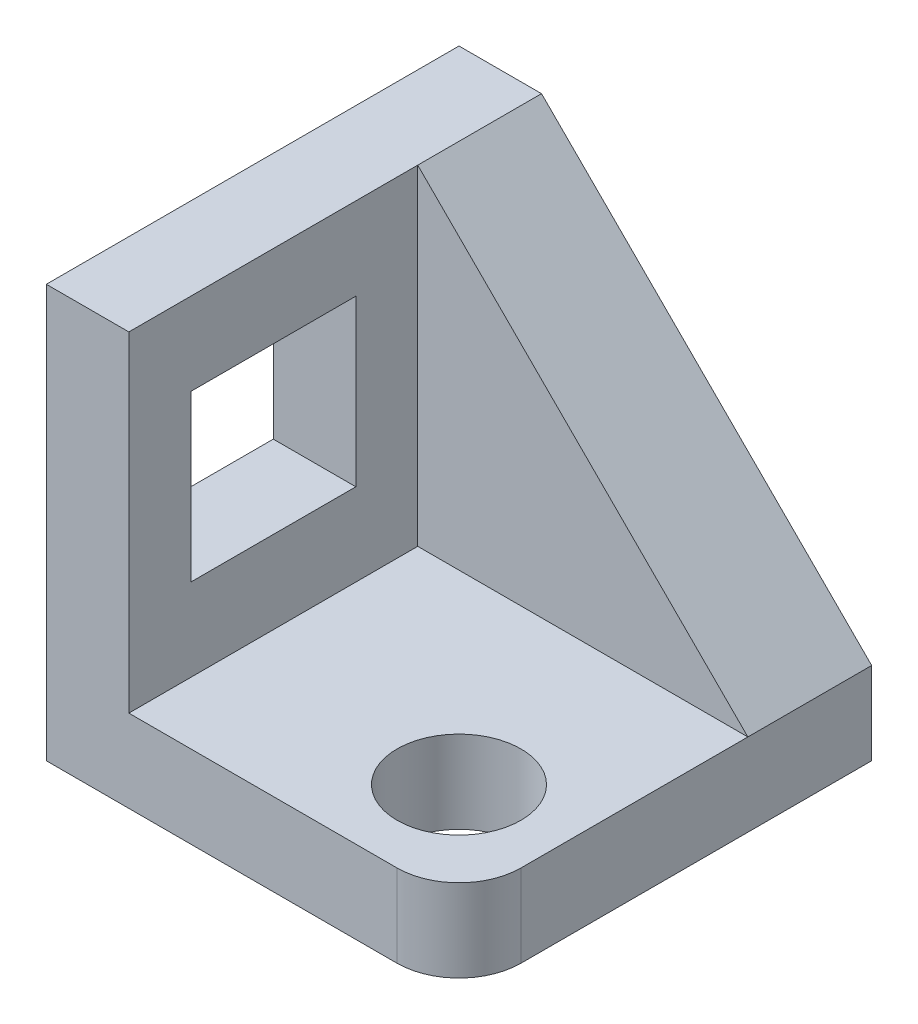
ISO-10303-21;
HEADER;
FILE_DESCRIPTION(('STEP AP214'),'2;1');
FILE_NAME('part.step','',(''),(''),'','','');
FILE_SCHEMA(('AUTOMOTIVE_DESIGN { 1 0 10303 214 1 1 1 1 }'));
ENDSEC;
DATA;
#1=APPLICATION_CONTEXT('core data for automotive mechanical design processes');
#2=APPLICATION_PROTOCOL_DEFINITION('international standard','automotive_design',2000,#1);
#3=PRODUCT_CONTEXT('',#1,'mechanical');
#4=PRODUCT('Part','Part','',(#3));
#5=PRODUCT_RELATED_PRODUCT_CATEGORY('part','',(#4));
#6=PRODUCT_DEFINITION_FORMATION('','',#4);
#7=PRODUCT_DEFINITION_CONTEXT('part definition',#1,'design');
#8=PRODUCT_DEFINITION('design','',#6,#7);
#9=PRODUCT_DEFINITION_SHAPE('','',#8);
#10=(LENGTH_UNIT() NAMED_UNIT(*) SI_UNIT(.MILLI.,.METRE.));
#11=(NAMED_UNIT(*) PLANE_ANGLE_UNIT() SI_UNIT($,.RADIAN.));
#12=(NAMED_UNIT(*) SI_UNIT($,.STERADIAN.) SOLID_ANGLE_UNIT());
#13=UNCERTAINTY_MEASURE_WITH_UNIT(LENGTH_MEASURE(1.E-05),#10,'distance_accuracy_value','');
#14=(GEOMETRIC_REPRESENTATION_CONTEXT(3) GLOBAL_UNCERTAINTY_ASSIGNED_CONTEXT((#13)) GLOBAL_UNIT_ASSIGNED_CONTEXT((#10,
#11,#12)) REPRESENTATION_CONTEXT('',''));
#15=CARTESIAN_POINT('',(0.,0.,0.));
#16=DIRECTION('',(0.,0.,1.));
#17=DIRECTION('',(1.,0.,0.));
#18=AXIS2_PLACEMENT_3D('',#15,#16,#17);
#19=CARTESIAN_POINT('',(0.,20.,0.));
#20=DIRECTION('',(0.,1.,0.));
#21=DIRECTION('',(0.,0.,1.));
#22=AXIS2_PLACEMENT_3D('',#19,#20,#21);
#23=PLANE('',#22);
#24=CARTESIAN_POINT('',(25.,20.,25.));
#25=DIRECTION('',(0.,1.,0.));
#26=DIRECTION('',(0.,0.,1.));
#27=AXIS2_PLACEMENT_3D('',#24,#25,#26);
#28=CIRCLE('',#27,15.);
#29=CARTESIAN_POINT('',(25.,20.,40.));
#30=VERTEX_POINT('',#29);
#31=EDGE_CURVE('E160',#30,#30,#28,.T.);
#32=ORIENTED_EDGE('',*,*,#31,.F.);
#33=EDGE_LOOP('',(#32));
#34=FACE_BOUND('',#33,.T.);
#35=DIRECTION('',(1.,0.,0.));
#36=VECTOR('',#35,1.);
#37=CARTESIAN_POINT('',(-50.,20.,50.));
#38=LINE('',#37,#36);
#39=CARTESIAN_POINT('',(-30.,20.,50.));
#40=VERTEX_POINT('',#39);
#41=CARTESIAN_POINT('',(35.,20.,50.));
#42=VERTEX_POINT('',#41);
#43=EDGE_CURVE('E217',#40,#42,#38,.T.);
#44=ORIENTED_EDGE('',*,*,#43,.T.);
#45=CARTESIAN_POINT('',(35.,20.,35.));
#46=DIRECTION('',(0.,1.,0.));
#47=DIRECTION('',(0.,0.,1.));
#48=AXIS2_PLACEMENT_3D('',#45,#46,#47);
#49=CIRCLE('',#48,15.);
#50=CARTESIAN_POINT('',(50.,20.,35.));
#51=VERTEX_POINT('',#50);
#52=EDGE_CURVE('E258',#42,#51,#49,.T.);
#53=ORIENTED_EDGE('',*,*,#52,.T.);
#54=DIRECTION('',(0.,0.,-1.));
#55=VECTOR('',#54,1.);
#56=CARTESIAN_POINT('',(50.,20.,-50.));
#57=LINE('',#56,#55);
#58=CARTESIAN_POINT('',(50.,20.,-20.));
#59=VERTEX_POINT('',#58);
#60=EDGE_CURVE('E214',#51,#59,#57,.T.);
#61=ORIENTED_EDGE('',*,*,#60,.T.);
#62=DIRECTION('',(1.,0.,0.));
#63=VECTOR('',#62,1.);
#64=CARTESIAN_POINT('',(-30.,20.,-20.));
#65=LINE('',#64,#63);
#66=CARTESIAN_POINT('',(-30.,20.,-20.));
#67=VERTEX_POINT('',#66);
#68=EDGE_CURVE('E184',#67,#59,#65,.T.);
#69=ORIENTED_EDGE('',*,*,#68,.F.);
#70=DIRECTION('',(0.,0.,-1.));
#71=VECTOR('',#70,1.);
#72=CARTESIAN_POINT('',(-30.,20.,-50.));
#73=LINE('',#72,#71);
#74=EDGE_CURVE('E191',#40,#67,#73,.T.);
#75=ORIENTED_EDGE('',*,*,#74,.F.);
#76=EDGE_LOOP('',(#44,#53,#61,#69,#75));
#77=FACE_BOUND('',#76,.T.);
#78=ADVANCED_FACE('F39',(#34,#77),#23,.T.);
#79=CARTESIAN_POINT('',(-30.,100.,-50.));
#80=DIRECTION('',(-1.,0.,0.));
#81=DIRECTION('',(0.,0.,1.));
#82=AXIS2_PLACEMENT_3D('',#79,#80,#81);
#83=PLANE('',#82);
#84=DIRECTION('',(0.,0.,1.));
#85=VECTOR('',#84,1.);
#86=CARTESIAN_POINT('',(-30.,80.,-5.00000000000002));
#87=LINE('',#86,#85);
#88=CARTESIAN_POINT('',(-30.,80.,-5.00000000000002));
#89=VERTEX_POINT('',#88);
#90=CARTESIAN_POINT('',(-30.,80.,35.));
#91=VERTEX_POINT('',#90);
#92=EDGE_CURVE('E142',#89,#91,#87,.T.);
#93=ORIENTED_EDGE('',*,*,#92,.F.);
#94=DIRECTION('',(0.,1.,0.));
#95=VECTOR('',#94,1.);
#96=CARTESIAN_POINT('',(-30.,80.,-5.00000000000002));
#97=LINE('',#96,#95);
#98=CARTESIAN_POINT('',(-30.,40.,-5.00000000000004));
#99=VERTEX_POINT('',#98);
#100=EDGE_CURVE('E55',#99,#89,#97,.T.);
#101=ORIENTED_EDGE('',*,*,#100,.F.);
#102=DIRECTION('',(0.,0.,-1.));
#103=VECTOR('',#102,1.);
#104=CARTESIAN_POINT('',(-30.,40.,-5.00000000000004));
#105=LINE('',#104,#103);
#106=CARTESIAN_POINT('',(-30.,40.,35.));
#107=VERTEX_POINT('',#106);
#108=EDGE_CURVE('E150',#107,#99,#105,.T.);
#109=ORIENTED_EDGE('',*,*,#108,.F.);
#110=DIRECTION('',(0.,-1.,0.));
#111=VECTOR('',#110,1.);
#112=CARTESIAN_POINT('',(-30.,80.,35.));
#113=LINE('',#112,#111);
#114=EDGE_CURVE('E132',#91,#107,#113,.T.);
#115=ORIENTED_EDGE('',*,*,#114,.F.);
#116=EDGE_LOOP('',(#93,#101,#109,#115));
#117=FACE_BOUND('',#116,.T.);
#118=DIRECTION('',(0.,-1.,0.));
#119=VECTOR('',#118,1.);
#120=CARTESIAN_POINT('',(-30.,100.,-20.));
#121=LINE('',#120,#119);
#122=CARTESIAN_POINT('',(-30.,100.,-20.));
#123=VERTEX_POINT('',#122);
#124=EDGE_CURVE('E188',#123,#67,#121,.T.);
#125=ORIENTED_EDGE('',*,*,#124,.F.);
#126=DIRECTION('',(0.,0.,-1.));
#127=VECTOR('',#126,1.);
#128=CARTESIAN_POINT('',(-30.,100.,-50.));
#129=LINE('',#128,#127);
#130=CARTESIAN_POINT('',(-30.,100.,50.));
#131=VERTEX_POINT('',#130);
#132=EDGE_CURVE('E199',#131,#123,#129,.T.);
#133=ORIENTED_EDGE('',*,*,#132,.F.);
#134=DIRECTION('',(0.,-1.,0.));
#135=VECTOR('',#134,1.);
#136=CARTESIAN_POINT('',(-30.,100.,50.));
#137=LINE('',#136,#135);
#138=EDGE_CURVE('E206',#131,#40,#137,.T.);
#139=ORIENTED_EDGE('',*,*,#138,.T.);
#140=ORIENTED_EDGE('',*,*,#74,.T.);
#141=EDGE_LOOP('',(#125,#133,#139,#140));
#142=FACE_BOUND('',#141,.T.);
#143=ADVANCED_FACE('F147',(#117,#142),#83,.F.);
#144=CARTESIAN_POINT('',(50.,20.,-50.));
#145=DIRECTION('',(-1.,0.,0.));
#146=DIRECTION('',(0.,0.,1.));
#147=AXIS2_PLACEMENT_3D('',#144,#145,#146);
#148=PLANE('',#147);
#149=ORIENTED_EDGE('',*,*,#60,.F.);
#150=DIRECTION('',(0.,-1.,0.));
#151=VECTOR('',#150,1.);
#152=CARTESIAN_POINT('',(50.,20.,35.));
#153=LINE('',#152,#151);
#154=CARTESIAN_POINT('',(50.,0.,35.));
#155=VERTEX_POINT('',#154);
#156=EDGE_CURVE('E245',#51,#155,#153,.T.);
#157=ORIENTED_EDGE('',*,*,#156,.T.);
#158=DIRECTION('',(0.,0.,-1.));
#159=VECTOR('',#158,1.);
#160=CARTESIAN_POINT('',(50.,0.,-50.));
#161=LINE('',#160,#159);
#162=CARTESIAN_POINT('',(50.,0.,-50.));
#163=VERTEX_POINT('',#162);
#164=EDGE_CURVE('E213',#155,#163,#161,.T.);
#165=ORIENTED_EDGE('',*,*,#164,.T.);
#166=DIRECTION('',(0.,-1.,0.));
#167=VECTOR('',#166,1.);
#168=CARTESIAN_POINT('',(50.,20.,-50.));
#169=LINE('',#168,#167);
#170=CARTESIAN_POINT('',(50.,20.,-50.));
#171=VERTEX_POINT('',#170);
#172=EDGE_CURVE('E241',#171,#163,#169,.T.);
#173=ORIENTED_EDGE('',*,*,#172,.F.);
#174=DIRECTION('',(0.,0.,1.));
#175=VECTOR('',#174,1.);
#176=CARTESIAN_POINT('',(50.,20.,-100.));
#177=LINE('',#176,#175);
#178=EDGE_CURVE('E174',#171,#59,#177,.T.);
#179=ORIENTED_EDGE('',*,*,#178,.T.);
#180=EDGE_LOOP('',(#149,#157,#165,#173,#179));
#181=FACE_BOUND('',#180,.T.);
#182=ADVANCED_FACE('F291',(#181),#148,.F.);
#183=CARTESIAN_POINT('',(-50.,20.,-50.));
#184=DIRECTION('',(0.,0.,1.));
#185=DIRECTION('',(1.,0.,0.));
#186=AXIS2_PLACEMENT_3D('',#183,#184,#185);
#187=PLANE('',#186);
#188=DIRECTION('',(-1.,0.,0.));
#189=VECTOR('',#188,1.);
#190=CARTESIAN_POINT('',(-50.,100.,-50.));
#191=LINE('',#190,#189);
#192=CARTESIAN_POINT('',(-30.,100.,-50.));
#193=VERTEX_POINT('',#192);
#194=CARTESIAN_POINT('',(-50.,100.,-50.));
#195=VERTEX_POINT('',#194);
#196=EDGE_CURVE('E203',#193,#195,#191,.T.);
#197=ORIENTED_EDGE('',*,*,#196,.F.);
#198=DIRECTION('',(0.707106781186548,-0.707106781186547,0.));
#199=VECTOR('',#198,1.);
#200=CARTESIAN_POINT('',(0.,70.,-50.));
#201=LINE('',#200,#199);
#202=EDGE_CURVE('E178',#193,#171,#201,.T.);
#203=ORIENTED_EDGE('',*,*,#202,.T.);
#204=ORIENTED_EDGE('',*,*,#172,.T.);
#205=DIRECTION('',(-1.,0.,0.));
#206=VECTOR('',#205,1.);
#207=CARTESIAN_POINT('',(-50.,0.,-50.));
#208=LINE('',#207,#206);
#209=CARTESIAN_POINT('',(-50.,0.,-50.));
#210=VERTEX_POINT('',#209);
#211=EDGE_CURVE('E225',#163,#210,#208,.T.);
#212=ORIENTED_EDGE('',*,*,#211,.T.);
#213=DIRECTION('',(0.,-1.,0.));
#214=VECTOR('',#213,1.);
#215=CARTESIAN_POINT('',(-50.,20.,-50.));
#216=LINE('',#215,#214);
#217=EDGE_CURVE('E237',#195,#210,#216,.T.);
#218=ORIENTED_EDGE('',*,*,#217,.F.);
#219=EDGE_LOOP('',(#197,#203,#204,#212,#218));
#220=FACE_BOUND('',#219,.T.);
#221=ADVANCED_FACE('F308',(#220),#187,.F.);
#222=CARTESIAN_POINT('',(-50.,20.,-50.));
#223=DIRECTION('',(1.,0.,0.));
#224=DIRECTION('',(0.,0.,-1.));
#225=AXIS2_PLACEMENT_3D('',#222,#223,#224);
#226=PLANE('',#225);
#227=DIRECTION('',(0.,0.,-1.));
#228=VECTOR('',#227,1.);
#229=CARTESIAN_POINT('',(-50.,40.,-50.));
#230=LINE('',#229,#228);
#231=CARTESIAN_POINT('',(-50.,40.,35.));
#232=VERTEX_POINT('',#231);
#233=CARTESIAN_POINT('',(-50.,40.,-5.00000000000003));
#234=VERTEX_POINT('',#233);
#235=EDGE_CURVE('E48',#232,#234,#230,.T.);
#236=ORIENTED_EDGE('',*,*,#235,.T.);
#237=DIRECTION('',(0.,1.,0.));
#238=VECTOR('',#237,1.);
#239=CARTESIAN_POINT('',(-50.,20.,-5.00000000000004));
#240=LINE('',#239,#238);
#241=CARTESIAN_POINT('',(-50.,80.,-5.00000000000002));
#242=VERTEX_POINT('',#241);
#243=EDGE_CURVE('E11',#234,#242,#240,.T.);
#244=ORIENTED_EDGE('',*,*,#243,.T.);
#245=DIRECTION('',(0.,0.,1.));
#246=VECTOR('',#245,1.);
#247=CARTESIAN_POINT('',(-50.,80.,-50.));
#248=LINE('',#247,#246);
#249=CARTESIAN_POINT('',(-50.,80.,35.));
#250=VERTEX_POINT('',#249);
#251=EDGE_CURVE('E261',#242,#250,#248,.T.);
#252=ORIENTED_EDGE('',*,*,#251,.T.);
#253=DIRECTION('',(0.,-1.,0.));
#254=VECTOR('',#253,1.);
#255=CARTESIAN_POINT('',(-50.,20.,35.));
#256=LINE('',#255,#254);
#257=EDGE_CURVE('E135',#250,#232,#256,.T.);
#258=ORIENTED_EDGE('',*,*,#257,.T.);
#259=EDGE_LOOP('',(#236,#244,#252,#258));
#260=FACE_BOUND('',#259,.T.);
#261=DIRECTION('',(0.,0.,1.));
#262=VECTOR('',#261,1.);
#263=CARTESIAN_POINT('',(-50.,0.,-50.));
#264=LINE('',#263,#262);
#265=CARTESIAN_POINT('',(-50.,0.,50.));
#266=VERTEX_POINT('',#265);
#267=EDGE_CURVE('E228',#210,#266,#264,.T.);
#268=ORIENTED_EDGE('',*,*,#267,.T.);
#269=DIRECTION('',(0.,-1.,0.));
#270=VECTOR('',#269,1.);
#271=CARTESIAN_POINT('',(-50.,20.,50.));
#272=LINE('',#271,#270);
#273=CARTESIAN_POINT('',(-50.,100.,50.));
#274=VERTEX_POINT('',#273);
#275=EDGE_CURVE('E222',#274,#266,#272,.T.);
#276=ORIENTED_EDGE('',*,*,#275,.F.);
#277=DIRECTION('',(0.,0.,1.));
#278=VECTOR('',#277,1.);
#279=CARTESIAN_POINT('',(-50.,100.,-50.));
#280=LINE('',#279,#278);
#281=EDGE_CURVE('E192',#195,#274,#280,.T.);
#282=ORIENTED_EDGE('',*,*,#281,.F.);
#283=ORIENTED_EDGE('',*,*,#217,.T.);
#284=EDGE_LOOP('',(#268,#276,#282,#283));
#285=FACE_BOUND('',#284,.T.);
#286=ADVANCED_FACE('F268',(#260,#285),#226,.F.);
#287=CARTESIAN_POINT('',(-50.,20.,50.));
#288=DIRECTION('',(0.,0.,-1.));
#289=DIRECTION('',(-1.,0.,0.));
#290=AXIS2_PLACEMENT_3D('',#287,#288,#289);
#291=PLANE('',#290);
#292=DIRECTION('',(1.,0.,0.));
#293=VECTOR('',#292,1.);
#294=CARTESIAN_POINT('',(-50.,0.,50.));
#295=LINE('',#294,#293);
#296=CARTESIAN_POINT('',(35.,0.,50.));
#297=VERTEX_POINT('',#296);
#298=EDGE_CURVE('E218',#266,#297,#295,.T.);
#299=ORIENTED_EDGE('',*,*,#298,.T.);
#300=DIRECTION('',(0.,-1.,0.));
#301=VECTOR('',#300,1.);
#302=CARTESIAN_POINT('',(35.,20.,50.));
#303=LINE('',#302,#301);
#304=EDGE_CURVE('E255',#297,#42,#303,.F.);
#305=ORIENTED_EDGE('',*,*,#304,.T.);
#306=ORIENTED_EDGE('',*,*,#43,.F.);
#307=ORIENTED_EDGE('',*,*,#138,.F.);
#308=DIRECTION('',(1.,0.,0.));
#309=VECTOR('',#308,1.);
#310=CARTESIAN_POINT('',(-50.,100.,50.));
#311=LINE('',#310,#309);
#312=EDGE_CURVE('E196',#274,#131,#311,.T.);
#313=ORIENTED_EDGE('',*,*,#312,.F.);
#314=ORIENTED_EDGE('',*,*,#275,.T.);
#315=EDGE_LOOP('',(#299,#305,#306,#307,#313,#314));
#316=FACE_BOUND('',#315,.T.);
#317=ADVANCED_FACE('F301',(#316),#291,.F.);
#318=CARTESIAN_POINT('',(0.,0.,0.));
#319=DIRECTION('',(0.,1.,0.));
#320=DIRECTION('',(0.,0.,1.));
#321=AXIS2_PLACEMENT_3D('',#318,#319,#320);
#322=PLANE('',#321);
#323=CARTESIAN_POINT('',(25.,0.,25.));
#324=DIRECTION('',(0.,1.,0.));
#325=DIRECTION('',(0.,0.,1.));
#326=AXIS2_PLACEMENT_3D('',#323,#324,#325);
#327=CIRCLE('',#326,15.);
#328=CARTESIAN_POINT('',(25.,0.,40.));
#329=VERTEX_POINT('',#328);
#330=EDGE_CURVE('E168',#329,#329,#327,.T.);
#331=ORIENTED_EDGE('',*,*,#330,.T.);
#332=EDGE_LOOP('',(#331));
#333=FACE_BOUND('',#332,.T.);
#334=ORIENTED_EDGE('',*,*,#164,.F.);
#335=CARTESIAN_POINT('',(35.,0.,35.));
#336=DIRECTION('',(0.,1.,0.));
#337=DIRECTION('',(0.,0.,1.));
#338=AXIS2_PLACEMENT_3D('',#335,#336,#337);
#339=CIRCLE('',#338,15.);
#340=EDGE_CURVE('E252',#155,#297,#339,.F.);
#341=ORIENTED_EDGE('',*,*,#340,.T.);
#342=ORIENTED_EDGE('',*,*,#298,.F.);
#343=ORIENTED_EDGE('',*,*,#267,.F.);
#344=ORIENTED_EDGE('',*,*,#211,.F.);
#345=EDGE_LOOP('',(#334,#341,#342,#343,#344));
#346=FACE_BOUND('',#345,.T.);
#347=ADVANCED_FACE('F297',(#333,#346),#322,.F.);
#348=CARTESIAN_POINT('',(0.,100.,0.));
#349=DIRECTION('',(0.,1.,0.));
#350=DIRECTION('',(0.,0.,1.));
#351=AXIS2_PLACEMENT_3D('',#348,#349,#350);
#352=PLANE('',#351);
#353=DIRECTION('',(0.,0.,1.));
#354=VECTOR('',#353,1.);
#355=CARTESIAN_POINT('',(-30.,100.,-100.));
#356=LINE('',#355,#354);
#357=EDGE_CURVE('E173',#193,#123,#356,.T.);
#358=ORIENTED_EDGE('',*,*,#357,.F.);
#359=ORIENTED_EDGE('',*,*,#196,.T.);
#360=ORIENTED_EDGE('',*,*,#281,.T.);
#361=ORIENTED_EDGE('',*,*,#312,.T.);
#362=ORIENTED_EDGE('',*,*,#132,.T.);
#363=EDGE_LOOP('',(#358,#359,#360,#361,#362));
#364=FACE_BOUND('',#363,.T.);
#365=ADVANCED_FACE('F300',(#364),#352,.T.);
#366=CARTESIAN_POINT('',(-30.,100.,-20.));
#367=DIRECTION('',(0.,0.,-1.));
#368=DIRECTION('',(-1.,0.,0.));
#369=AXIS2_PLACEMENT_3D('',#366,#367,#368);
#370=PLANE('',#369);
#371=ORIENTED_EDGE('',*,*,#68,.T.);
#372=DIRECTION('',(0.707106781186548,-0.707106781186547,0.));
#373=VECTOR('',#372,1.);
#374=CARTESIAN_POINT('',(50.,20.,-20.));
#375=LINE('',#374,#373);
#376=EDGE_CURVE('E169',#123,#59,#375,.T.);
#377=ORIENTED_EDGE('',*,*,#376,.F.);
#378=ORIENTED_EDGE('',*,*,#124,.T.);
#379=EDGE_LOOP('',(#371,#377,#378));
#380=FACE_BOUND('',#379,.T.);
#381=ADVANCED_FACE('F340',(#380),#370,.F.);
#382=CARTESIAN_POINT('',(50.,20.,-100.));
#383=DIRECTION('',(-0.707106781186547,-0.707106781186548,0.));
#384=DIRECTION('',(0.707106781186548,-0.707106781186547,0.));
#385=AXIS2_PLACEMENT_3D('',#382,#383,#384);
#386=PLANE('',#385);
#387=ORIENTED_EDGE('',*,*,#357,.T.);
#388=ORIENTED_EDGE('',*,*,#376,.T.);
#389=ORIENTED_EDGE('',*,*,#178,.F.);
#390=ORIENTED_EDGE('',*,*,#202,.F.);
#391=EDGE_LOOP('',(#387,#388,#389,#390));
#392=FACE_BOUND('',#391,.T.);
#393=ADVANCED_FACE('F334',(#392),#386,.F.);
#394=CARTESIAN_POINT('',(25.,-60.,25.));
#395=DIRECTION('',(0.,1.,0.));
#396=DIRECTION('',(0.,0.,1.));
#397=AXIS2_PLACEMENT_3D('',#394,#395,#396);
#398=CYLINDRICAL_SURFACE('',#397,15.);
#399=ORIENTED_EDGE('',*,*,#31,.T.);
#400=EDGE_LOOP('',(#399));
#401=FACE_BOUND('',#400,.T.);
#402=ORIENTED_EDGE('',*,*,#330,.F.);
#403=EDGE_LOOP('',(#402));
#404=FACE_BOUND('',#403,.T.);
#405=ADVANCED_FACE('F281',(#401,#404),#398,.F.);
#406=CARTESIAN_POINT('',(35.,20.,35.));
#407=DIRECTION('',(0.,-1.,0.));
#408=DIRECTION('',(0.,0.,-1.));
#409=AXIS2_PLACEMENT_3D('',#406,#407,#408);
#410=CYLINDRICAL_SURFACE('',#409,15.);
#411=ORIENTED_EDGE('',*,*,#52,.F.);
#412=ORIENTED_EDGE('',*,*,#304,.F.);
#413=ORIENTED_EDGE('',*,*,#340,.F.);
#414=ORIENTED_EDGE('',*,*,#156,.F.);
#415=EDGE_LOOP('',(#411,#412,#413,#414));
#416=FACE_BOUND('',#415,.T.);
#417=ADVANCED_FACE('F41',(#416),#410,.T.);
#418=CARTESIAN_POINT('',(-110.,80.,-5.00000000000001));
#419=DIRECTION('',(0.,0.,-1.));
#420=DIRECTION('',(0.,1.,0.));
#421=AXIS2_PLACEMENT_3D('',#418,#419,#420);
#422=PLANE('',#421);
#423=DIRECTION('',(1.,0.,0.));
#424=VECTOR('',#423,1.);
#425=CARTESIAN_POINT('',(-110.,40.,-5.00000000000002));
#426=LINE('',#425,#424);
#427=EDGE_CURVE('E157',#234,#99,#426,.T.);
#428=ORIENTED_EDGE('',*,*,#427,.T.);
#429=ORIENTED_EDGE('',*,*,#100,.T.);
#430=DIRECTION('',(1.,0.,0.));
#431=VECTOR('',#430,1.);
#432=CARTESIAN_POINT('',(-110.,80.,-5.00000000000001));
#433=LINE('',#432,#431);
#434=EDGE_CURVE('E139',#242,#89,#433,.T.);
#435=ORIENTED_EDGE('',*,*,#434,.F.);
#436=ORIENTED_EDGE('',*,*,#243,.F.);
#437=EDGE_LOOP('',(#428,#429,#435,#436));
#438=FACE_BOUND('',#437,.T.);
#439=ADVANCED_FACE('F273',(#438),#422,.F.);
#440=CARTESIAN_POINT('',(-110.,40.,-5.00000000000002));
#441=DIRECTION('',(0.,-1.,0.));
#442=DIRECTION('',(0.,0.,-1.));
#443=AXIS2_PLACEMENT_3D('',#440,#441,#442);
#444=PLANE('',#443);
#445=DIRECTION('',(1.,0.,0.));
#446=VECTOR('',#445,1.);
#447=CARTESIAN_POINT('',(-110.,40.,35.));
#448=LINE('',#447,#446);
#449=EDGE_CURVE('E138',#232,#107,#448,.T.);
#450=ORIENTED_EDGE('',*,*,#449,.T.);
#451=ORIENTED_EDGE('',*,*,#108,.T.);
#452=ORIENTED_EDGE('',*,*,#427,.F.);
#453=ORIENTED_EDGE('',*,*,#235,.F.);
#454=EDGE_LOOP('',(#450,#451,#452,#453));
#455=FACE_BOUND('',#454,.T.);
#456=ADVANCED_FACE('F272',(#455),#444,.F.);
#457=CARTESIAN_POINT('',(-110.,80.,35.));
#458=DIRECTION('',(0.,0.,1.));
#459=DIRECTION('',(1.,0.,0.));
#460=AXIS2_PLACEMENT_3D('',#457,#458,#459);
#461=PLANE('',#460);
#462=DIRECTION('',(1.,0.,0.));
#463=VECTOR('',#462,1.);
#464=CARTESIAN_POINT('',(-110.,80.,35.));
#465=LINE('',#464,#463);
#466=EDGE_CURVE('E63',#250,#91,#465,.T.);
#467=ORIENTED_EDGE('',*,*,#466,.T.);
#468=ORIENTED_EDGE('',*,*,#114,.T.);
#469=ORIENTED_EDGE('',*,*,#449,.F.);
#470=ORIENTED_EDGE('',*,*,#257,.F.);
#471=EDGE_LOOP('',(#467,#468,#469,#470));
#472=FACE_BOUND('',#471,.T.);
#473=ADVANCED_FACE('F129',(#472),#461,.F.);
#474=CARTESIAN_POINT('',(-110.,80.,-5.00000000000001));
#475=DIRECTION('',(0.,1.,0.));
#476=DIRECTION('',(0.,0.,1.));
#477=AXIS2_PLACEMENT_3D('',#474,#475,#476);
#478=PLANE('',#477);
#479=ORIENTED_EDGE('',*,*,#434,.T.);
#480=ORIENTED_EDGE('',*,*,#92,.T.);
#481=ORIENTED_EDGE('',*,*,#466,.F.);
#482=ORIENTED_EDGE('',*,*,#251,.F.);
#483=EDGE_LOOP('',(#479,#480,#481,#482));
#484=FACE_BOUND('',#483,.T.);
#485=ADVANCED_FACE('F143',(#484),#478,.F.);
#486=CLOSED_SHELL('',(#78,#143,#182,#221,#286,#317,#347,#365,#381,#393,#405,#417,#439,#456,#473,#485));
#487=MANIFOLD_SOLID_BREP('B2',#486);
#488=ADVANCED_BREP_SHAPE_REPRESENTATION('',(#18,#487),#14);
#489=SHAPE_DEFINITION_REPRESENTATION(#9,#488);
ENDSEC;
END-ISO-10303-21;
